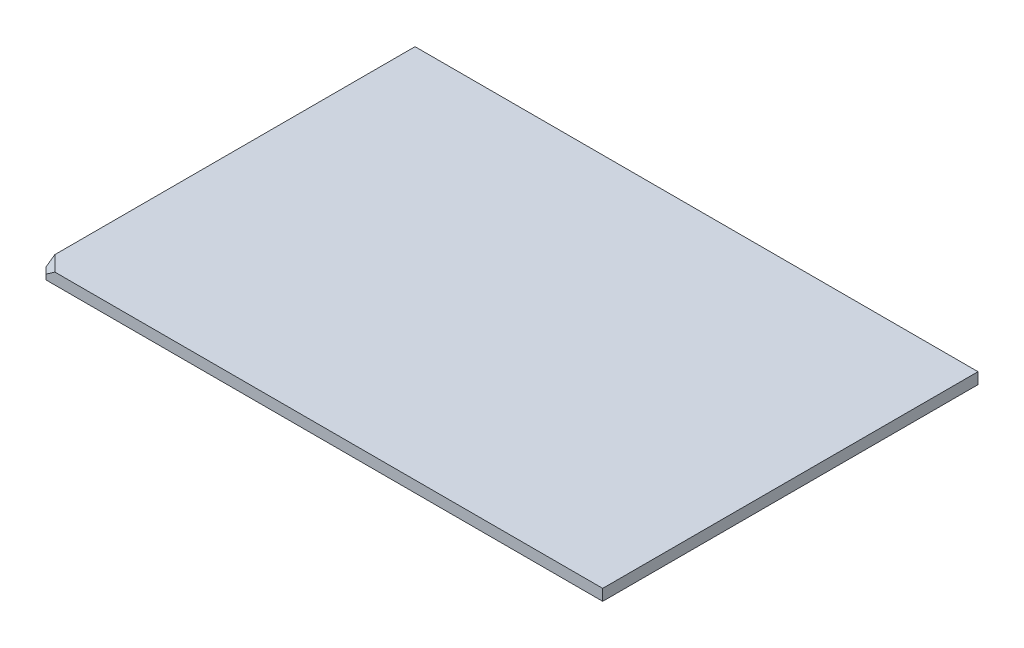
ISO-10303-21;
HEADER;
FILE_DESCRIPTION(('STEP AP214'),'2;1');
FILE_NAME('part.step','',(''),(''),'','','');
FILE_SCHEMA(('AUTOMOTIVE_DESIGN { 1 0 10303 214 1 1 1 1 }'));
ENDSEC;
DATA;
#1=APPLICATION_CONTEXT('core data for automotive mechanical design processes');
#2=APPLICATION_PROTOCOL_DEFINITION('international standard','automotive_design',2000,#1);
#3=PRODUCT_CONTEXT('',#1,'mechanical');
#4=PRODUCT('Part','Part','',(#3));
#5=PRODUCT_RELATED_PRODUCT_CATEGORY('part','',(#4));
#6=PRODUCT_DEFINITION_FORMATION('','',#4);
#7=PRODUCT_DEFINITION_CONTEXT('part definition',#1,'design');
#8=PRODUCT_DEFINITION('design','',#6,#7);
#9=PRODUCT_DEFINITION_SHAPE('','',#8);
#10=(LENGTH_UNIT() NAMED_UNIT(*) SI_UNIT(.MILLI.,.METRE.));
#11=(NAMED_UNIT(*) PLANE_ANGLE_UNIT() SI_UNIT($,.RADIAN.));
#12=(NAMED_UNIT(*) SI_UNIT($,.STERADIAN.) SOLID_ANGLE_UNIT());
#13=UNCERTAINTY_MEASURE_WITH_UNIT(LENGTH_MEASURE(1.E-05),#10,'distance_accuracy_value','');
#14=(GEOMETRIC_REPRESENTATION_CONTEXT(3) GLOBAL_UNCERTAINTY_ASSIGNED_CONTEXT((#13)) GLOBAL_UNIT_ASSIGNED_CONTEXT((#10,
#11,#12)) REPRESENTATION_CONTEXT('',''));
#15=CARTESIAN_POINT('',(0.,0.,0.));
#16=DIRECTION('',(0.,0.,1.));
#17=DIRECTION('',(1.,0.,0.));
#18=AXIS2_PLACEMENT_3D('',#15,#16,#17);
#19=CARTESIAN_POINT('',(-26.9712669172933,9.,-282.549436090226));
#20=DIRECTION('',(1.,0.,0.));
#21=DIRECTION('',(0.,0.,-1.));
#22=AXIS2_PLACEMENT_3D('',#19,#20,#21);
#23=PLANE('',#22);
#24=DIRECTION('',(0.,1.,0.));
#25=VECTOR('',#24,1.);
#26=CARTESIAN_POINT('',(-26.9712669172932,9.,12.4505639097744));
#27=LINE('',#26,#25);
#28=CARTESIAN_POINT('',(-26.9712669172932,0.,12.4505639097744));
#29=VERTEX_POINT('',#28);
#30=CARTESIAN_POINT('',(-26.9712669172932,3.99999999999999,12.4505639097744));
#31=VERTEX_POINT('',#30);
#32=EDGE_CURVE('E130',#29,#31,#27,.T.);
#33=ORIENTED_EDGE('',*,*,#32,.T.);
#34=DIRECTION('',(0.,0.577350269189624,-0.816496580927727));
#35=VECTOR('',#34,1.);
#36=CARTESIAN_POINT('',(-26.9712669172932,3.91077081192918,12.5767530377037));
#37=LINE('',#36,#35);
#38=CARTESIAN_POINT('',(-26.9712669172932,8.99999999999998,5.37949609790893));
#39=VERTEX_POINT('',#38);
#40=EDGE_CURVE('E11',#31,#39,#37,.T.);
#41=ORIENTED_EDGE('',*,*,#40,.T.);
#42=DIRECTION('',(0.,0.,1.));
#43=VECTOR('',#42,1.);
#44=CARTESIAN_POINT('',(-26.9712669172933,9.,-282.549436090226));
#45=LINE('',#44,#43);
#46=CARTESIAN_POINT('',(-26.9712669172933,9.,-282.549436090226));
#47=VERTEX_POINT('',#46);
#48=EDGE_CURVE('E95',#47,#39,#45,.T.);
#49=ORIENTED_EDGE('',*,*,#48,.F.);
#50=DIRECTION('',(0.,-1.,0.));
#51=VECTOR('',#50,1.);
#52=CARTESIAN_POINT('',(-26.9712669172933,9.,-282.549436090226));
#53=LINE('',#52,#51);
#54=CARTESIAN_POINT('',(-26.9712669172933,0.,-282.549436090226));
#55=VERTEX_POINT('',#54);
#56=EDGE_CURVE('E112',#47,#55,#53,.T.);
#57=ORIENTED_EDGE('',*,*,#56,.T.);
#58=DIRECTION('',(0.,0.,1.));
#59=VECTOR('',#58,1.);
#60=CARTESIAN_POINT('',(-26.9712669172933,0.,-282.549436090226));
#61=LINE('',#60,#59);
#62=EDGE_CURVE('E116',#55,#29,#61,.T.);
#63=ORIENTED_EDGE('',*,*,#62,.T.);
#64=EDGE_LOOP('',(#33,#41,#49,#57,#63));
#65=FACE_BOUND('',#64,.T.);
#66=ADVANCED_FACE('F35',(#65),#23,.F.);
#67=CARTESIAN_POINT('',(-26.9712669172932,9.,17.4505639097744));
#68=DIRECTION('',(0.,0.,-1.));
#69=DIRECTION('',(-1.,0.,0.));
#70=AXIS2_PLACEMENT_3D('',#67,#68,#69);
#71=PLANE('',#70);
#72=DIRECTION('',(1.,0.,0.));
#73=VECTOR('',#72,1.);
#74=CARTESIAN_POINT('',(-26.9712669172932,9.,17.4505639097744));
#75=LINE('',#74,#73);
#76=CARTESIAN_POINT('',(-14.9001991054277,9.,17.4505639097744));
#77=VERTEX_POINT('',#76);
#78=CARTESIAN_POINT('',(423.028733082707,9.,17.4505639097744));
#79=VERTEX_POINT('',#78);
#80=EDGE_CURVE('E86',#77,#79,#75,.T.);
#81=ORIENTED_EDGE('',*,*,#80,.F.);
#82=DIRECTION('',(-0.816496580927726,-0.577350269189626,0.));
#83=VECTOR('',#82,1.);
#84=CARTESIAN_POINT('',(-15.7503207068767,8.3988732507823,17.4505639097744));
#85=LINE('',#84,#83);
#86=CARTESIAN_POINT('',(-21.9712669172932,4.,17.4505639097744));
#87=VERTEX_POINT('',#86);
#88=EDGE_CURVE('E57',#77,#87,#85,.T.);
#89=ORIENTED_EDGE('',*,*,#88,.T.);
#90=DIRECTION('',(0.,-1.,0.));
#91=VECTOR('',#90,1.);
#92=CARTESIAN_POINT('',(-21.9712669172932,9.,17.4505639097744));
#93=LINE('',#92,#91);
#94=CARTESIAN_POINT('',(-21.9712669172932,0.,17.4505639097744));
#95=VERTEX_POINT('',#94);
#96=EDGE_CURVE('E104',#87,#95,#93,.T.);
#97=ORIENTED_EDGE('',*,*,#96,.T.);
#98=DIRECTION('',(1.,0.,0.));
#99=VECTOR('',#98,1.);
#100=CARTESIAN_POINT('',(-26.9712669172932,0.,17.4505639097744));
#101=LINE('',#100,#99);
#102=CARTESIAN_POINT('',(423.028733082707,0.,17.4505639097744));
#103=VERTEX_POINT('',#102);
#104=EDGE_CURVE('E101',#95,#103,#101,.T.);
#105=ORIENTED_EDGE('',*,*,#104,.T.);
#106=DIRECTION('',(0.,-1.,0.));
#107=VECTOR('',#106,1.);
#108=CARTESIAN_POINT('',(423.028733082707,9.,17.4505639097744));
#109=LINE('',#108,#107);
#110=EDGE_CURVE('E98',#79,#103,#109,.T.);
#111=ORIENTED_EDGE('',*,*,#110,.F.);
#112=EDGE_LOOP('',(#81,#89,#97,#105,#111));
#113=FACE_BOUND('',#112,.T.);
#114=ADVANCED_FACE('F99',(#113),#71,.F.);
#115=CARTESIAN_POINT('',(423.028733082707,9.,-282.549436090226));
#116=DIRECTION('',(-1.,0.,0.));
#117=DIRECTION('',(0.,0.,1.));
#118=AXIS2_PLACEMENT_3D('',#115,#116,#117);
#119=PLANE('',#118);
#120=DIRECTION('',(0.,0.,-1.));
#121=VECTOR('',#120,1.);
#122=CARTESIAN_POINT('',(423.028733082707,0.,-282.549436090226));
#123=LINE('',#122,#121);
#124=CARTESIAN_POINT('',(423.028733082707,0.,-282.549436090226));
#125=VERTEX_POINT('',#124);
#126=EDGE_CURVE('E120',#103,#125,#123,.T.);
#127=ORIENTED_EDGE('',*,*,#126,.T.);
#128=DIRECTION('',(0.,-1.,0.));
#129=VECTOR('',#128,1.);
#130=CARTESIAN_POINT('',(423.028733082707,9.,-282.549436090226));
#131=LINE('',#130,#129);
#132=CARTESIAN_POINT('',(423.028733082707,9.,-282.549436090226));
#133=VERTEX_POINT('',#132);
#134=EDGE_CURVE('E105',#133,#125,#131,.T.);
#135=ORIENTED_EDGE('',*,*,#134,.F.);
#136=DIRECTION('',(0.,0.,-1.));
#137=VECTOR('',#136,1.);
#138=CARTESIAN_POINT('',(423.028733082707,9.,-282.549436090226));
#139=LINE('',#138,#137);
#140=EDGE_CURVE('E91',#79,#133,#139,.T.);
#141=ORIENTED_EDGE('',*,*,#140,.F.);
#142=ORIENTED_EDGE('',*,*,#110,.T.);
#143=EDGE_LOOP('',(#127,#135,#141,#142));
#144=FACE_BOUND('',#143,.T.);
#145=ADVANCED_FACE('F107',(#144),#119,.F.);
#146=CARTESIAN_POINT('',(-26.9712669172933,9.,-282.549436090226));
#147=DIRECTION('',(0.,0.,1.));
#148=DIRECTION('',(1.,0.,0.));
#149=AXIS2_PLACEMENT_3D('',#146,#147,#148);
#150=PLANE('',#149);
#151=DIRECTION('',(-1.,0.,0.));
#152=VECTOR('',#151,1.);
#153=CARTESIAN_POINT('',(-26.9712669172933,0.,-282.549436090226));
#154=LINE('',#153,#152);
#155=EDGE_CURVE('E122',#125,#55,#154,.T.);
#156=ORIENTED_EDGE('',*,*,#155,.T.);
#157=ORIENTED_EDGE('',*,*,#56,.F.);
#158=DIRECTION('',(-1.,0.,0.));
#159=VECTOR('',#158,1.);
#160=CARTESIAN_POINT('',(-26.9712669172933,9.,-282.549436090226));
#161=LINE('',#160,#159);
#162=EDGE_CURVE('E110',#133,#47,#161,.T.);
#163=ORIENTED_EDGE('',*,*,#162,.F.);
#164=ORIENTED_EDGE('',*,*,#134,.T.);
#165=EDGE_LOOP('',(#156,#157,#163,#164));
#166=FACE_BOUND('',#165,.T.);
#167=ADVANCED_FACE('F154',(#166),#150,.F.);
#168=CARTESIAN_POINT('',(0.,9.,0.));
#169=DIRECTION('',(0.,1.,0.));
#170=DIRECTION('',(0.,0.,1.));
#171=AXIS2_PLACEMENT_3D('',#168,#169,#170);
#172=PLANE('',#171);
#173=ORIENTED_EDGE('',*,*,#48,.T.);
#174=DIRECTION('',(0.707106781186546,0.,0.707106781186549));
#175=VECTOR('',#174,1.);
#176=CARTESIAN_POINT('',(-16.1753815076011,9.,16.175381507601));
#177=LINE('',#176,#175);
#178=EDGE_CURVE('E94',#39,#77,#177,.T.);
#179=ORIENTED_EDGE('',*,*,#178,.T.);
#180=ORIENTED_EDGE('',*,*,#80,.T.);
#181=ORIENTED_EDGE('',*,*,#140,.T.);
#182=ORIENTED_EDGE('',*,*,#162,.T.);
#183=EDGE_LOOP('',(#173,#179,#180,#181,#182));
#184=FACE_BOUND('',#183,.T.);
#185=ADVANCED_FACE('F89',(#184),#172,.T.);
#186=CARTESIAN_POINT('',(0.,0.,0.));
#187=DIRECTION('',(0.,1.,0.));
#188=DIRECTION('',(0.,0.,1.));
#189=AXIS2_PLACEMENT_3D('',#186,#187,#188);
#190=PLANE('',#189);
#191=ORIENTED_EDGE('',*,*,#104,.F.);
#192=DIRECTION('',(0.707106781186546,0.,0.707106781186549));
#193=VECTOR('',#192,1.);
#194=CARTESIAN_POINT('',(-21.9712669172932,0.,17.4505639097744));
#195=LINE('',#194,#193);
#196=EDGE_CURVE('E128',#95,#29,#195,.F.);
#197=ORIENTED_EDGE('',*,*,#196,.T.);
#198=ORIENTED_EDGE('',*,*,#62,.F.);
#199=ORIENTED_EDGE('',*,*,#155,.F.);
#200=ORIENTED_EDGE('',*,*,#126,.F.);
#201=EDGE_LOOP('',(#191,#197,#198,#199,#200));
#202=FACE_BOUND('',#201,.T.);
#203=ADVANCED_FACE('F144',(#202),#190,.F.);
#204=CARTESIAN_POINT('',(-21.9712669172932,9.,17.4505639097744));
#205=DIRECTION('',(0.707106781186549,0.,-0.707106781186545));
#206=DIRECTION('',(0.,-1.,0.));
#207=AXIS2_PLACEMENT_3D('',#204,#205,#206);
#208=PLANE('',#207);
#209=ORIENTED_EDGE('',*,*,#96,.F.);
#210=DIRECTION('',(0.707106781186546,0.,0.707106781186549));
#211=VECTOR('',#210,1.);
#212=CARTESIAN_POINT('',(-21.9712669172932,4.,17.4505639097744));
#213=LINE('',#212,#211);
#214=EDGE_CURVE('E43',#87,#31,#213,.F.);
#215=ORIENTED_EDGE('',*,*,#214,.T.);
#216=ORIENTED_EDGE('',*,*,#32,.F.);
#217=ORIENTED_EDGE('',*,*,#196,.F.);
#218=EDGE_LOOP('',(#209,#215,#216,#217));
#219=FACE_BOUND('',#218,.T.);
#220=ADVANCED_FACE('F140',(#219),#208,.F.);
#221=CARTESIAN_POINT('',(-16.1753815076011,9.,16.175381507601));
#222=DIRECTION('',(-0.500000000000001,0.707106781186548,0.499999999999998));
#223=DIRECTION('',(-0.707106781186546,0.,-0.707106781186549));
#224=AXIS2_PLACEMENT_3D('',#221,#222,#223);
#225=PLANE('',#224);
#226=ORIENTED_EDGE('',*,*,#40,.F.);
#227=ORIENTED_EDGE('',*,*,#214,.F.);
#228=ORIENTED_EDGE('',*,*,#88,.F.);
#229=ORIENTED_EDGE('',*,*,#178,.F.);
#230=EDGE_LOOP('',(#226,#227,#228,#229));
#231=FACE_BOUND('',#230,.T.);
#232=ADVANCED_FACE('F37',(#231),#225,.T.);
#233=CLOSED_SHELL('',(#66,#114,#145,#167,#185,#203,#220,#232));
#234=MANIFOLD_SOLID_BREP('B2',#233);
#235=ADVANCED_BREP_SHAPE_REPRESENTATION('',(#18,#234),#14);
#236=SHAPE_DEFINITION_REPRESENTATION(#9,#235);
ENDSEC;
END-ISO-10303-21;
